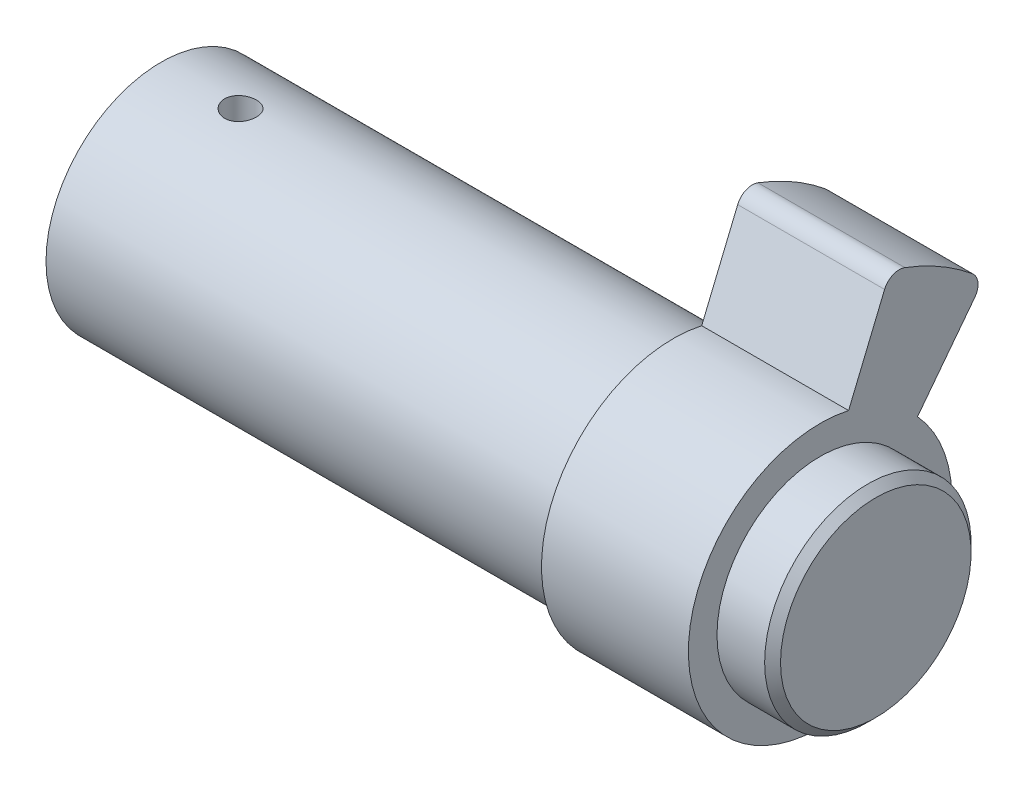
ISO-10303-21;
HEADER;
FILE_DESCRIPTION(('STEP AP214'),'2;1');
FILE_NAME('part.step','',(''),(''),'','','');
FILE_SCHEMA(('AUTOMOTIVE_DESIGN { 1 0 10303 214 1 1 1 1 }'));
ENDSEC;
DATA;
#1=APPLICATION_CONTEXT('core data for automotive mechanical design processes');
#2=APPLICATION_PROTOCOL_DEFINITION('international standard','automotive_design',2000,#1);
#3=PRODUCT_CONTEXT('',#1,'mechanical');
#4=PRODUCT('Part','Part','',(#3));
#5=PRODUCT_RELATED_PRODUCT_CATEGORY('part','',(#4));
#6=PRODUCT_DEFINITION_FORMATION('','',#4);
#7=PRODUCT_DEFINITION_CONTEXT('part definition',#1,'design');
#8=PRODUCT_DEFINITION('design','',#6,#7);
#9=PRODUCT_DEFINITION_SHAPE('','',#8);
#10=(LENGTH_UNIT() NAMED_UNIT(*) SI_UNIT(.MILLI.,.METRE.));
#11=(NAMED_UNIT(*) PLANE_ANGLE_UNIT() SI_UNIT($,.RADIAN.));
#12=(NAMED_UNIT(*) SI_UNIT($,.STERADIAN.) SOLID_ANGLE_UNIT());
#13=UNCERTAINTY_MEASURE_WITH_UNIT(LENGTH_MEASURE(1.E-05),#10,'distance_accuracy_value','');
#14=(GEOMETRIC_REPRESENTATION_CONTEXT(3) GLOBAL_UNCERTAINTY_ASSIGNED_CONTEXT((#13)) GLOBAL_UNIT_ASSIGNED_CONTEXT((#10,
#11,#12)) REPRESENTATION_CONTEXT('',''));
#15=CARTESIAN_POINT('',(0.,0.,0.));
#16=DIRECTION('',(0.,0.,1.));
#17=DIRECTION('',(1.,0.,0.));
#18=AXIS2_PLACEMENT_3D('',#15,#16,#17);
#19=CARTESIAN_POINT('',(45.,0.,0.));
#20=DIRECTION('',(1.,0.,0.));
#21=DIRECTION('',(0.,0.,-1.));
#22=AXIS2_PLACEMENT_3D('',#19,#20,#21);
#23=PLANE('',#22);
#24=CARTESIAN_POINT('',(44.9999999999591,0.,0.));
#25=DIRECTION('',(-1.,0.,0.));
#26=DIRECTION('',(0.,0.,1.));
#27=AXIS2_PLACEMENT_3D('',#24,#25,#26);
#28=CIRCLE('',#27,6.00000000002865);
#29=CARTESIAN_POINT('',(44.9999999999591,0.,6.00000000002865));
#30=VERTEX_POINT('',#29);
#31=EDGE_CURVE('E20',#30,#30,#28,.T.);
#32=ORIENTED_EDGE('',*,*,#31,.F.);
#33=EDGE_LOOP('',(#32));
#34=FACE_BOUND('',#33,.T.);
#35=ADVANCED_FACE('F17',(#34),#23,.T.);
#36=CARTESIAN_POINT('',(44.5000000000277,0.,0.));
#37=DIRECTION('',(-1.,0.,0.));
#38=DIRECTION('',(0.,0.,1.));
#39=AXIS2_PLACEMENT_3D('',#36,#37,#38);
#40=CONICAL_SURFACE('',#39,6.49999999995998,0.785398163397448);
#41=ORIENTED_EDGE('',*,*,#31,.T.);
#42=EDGE_LOOP('',(#41));
#43=FACE_BOUND('',#42,.T.);
#44=CARTESIAN_POINT('',(44.5,0.,0.));
#45=DIRECTION('',(-1.,0.,0.));
#46=DIRECTION('',(0.,0.,1.));
#47=AXIS2_PLACEMENT_3D('',#44,#45,#46);
#48=CIRCLE('',#47,6.5);
#49=CARTESIAN_POINT('',(44.5,0.,6.5));
#50=VERTEX_POINT('',#49);
#51=EDGE_CURVE('E98',#50,#50,#48,.T.);
#52=ORIENTED_EDGE('',*,*,#51,.F.);
#53=EDGE_LOOP('',(#52));
#54=FACE_BOUND('',#53,.T.);
#55=ADVANCED_FACE('F220',(#43,#54),#40,.T.);
#56=CARTESIAN_POINT('',(45.,0.,0.));
#57=DIRECTION('',(-1.,0.,0.));
#58=DIRECTION('',(0.,0.,1.));
#59=AXIS2_PLACEMENT_3D('',#56,#57,#58);
#60=CYLINDRICAL_SURFACE('',#59,6.5);
#61=ORIENTED_EDGE('',*,*,#51,.T.);
#62=EDGE_LOOP('',(#61));
#63=FACE_BOUND('',#62,.T.);
#64=CARTESIAN_POINT('',(41.5,0.,0.));
#65=DIRECTION('',(-1.,0.,0.));
#66=DIRECTION('',(0.,0.,1.));
#67=AXIS2_PLACEMENT_3D('',#64,#65,#66);
#68=CIRCLE('',#67,6.5);
#69=CARTESIAN_POINT('',(41.5,0.,6.5));
#70=VERTEX_POINT('',#69);
#71=EDGE_CURVE('E342',#70,#70,#68,.F.);
#72=ORIENTED_EDGE('',*,*,#71,.T.);
#73=EDGE_LOOP('',(#72));
#74=FACE_BOUND('',#73,.T.);
#75=ADVANCED_FACE('F218',(#63,#74),#60,.T.);
#76=CARTESIAN_POINT('',(41.5,10.9062733382579,-8.93662139016782));
#77=DIRECTION('',(-1.,0.,0.));
#78=DIRECTION('',(0.,0.,1.));
#79=AXIS2_PLACEMENT_3D('',#76,#77,#78);
#80=CYLINDRICAL_SURFACE('',#79,1.);
#81=CARTESIAN_POINT('',(32.25,10.9062733382579,-8.93662139016782));
#82=DIRECTION('',(-1.,0.,0.));
#83=DIRECTION('',(0.,0.,1.));
#84=AXIS2_PLACEMENT_3D('',#81,#82,#83);
#85=CIRCLE('',#84,1.);
#86=CARTESIAN_POINT('',(32.25,10.2975119092492,-9.72997473045906));
#87=VERTEX_POINT('',#86);
#88=CARTESIAN_POINT('',(32.25,11.6797679012549,-9.57042432564072));
#89=VERTEX_POINT('',#88);
#90=EDGE_CURVE('E85',#87,#89,#85,.F.);
#91=ORIENTED_EDGE('',*,*,#90,.T.);
#92=DIRECTION('',(-1.,0.,0.));
#93=VECTOR('',#92,1.);
#94=CARTESIAN_POINT('',(41.5,11.6797679012549,-9.57042432564072));
#95=LINE('',#94,#93);
#96=CARTESIAN_POINT('',(41.5,11.6797679012549,-9.57042432564072));
#97=VERTEX_POINT('',#96);
#98=EDGE_CURVE('E92',#97,#89,#95,.T.);
#99=ORIENTED_EDGE('',*,*,#98,.F.);
#100=CARTESIAN_POINT('',(41.5,10.9062733382579,-8.93662139016782));
#101=DIRECTION('',(-1.,0.,0.));
#102=DIRECTION('',(0.,0.,1.));
#103=AXIS2_PLACEMENT_3D('',#100,#101,#102);
#104=CIRCLE('',#103,1.);
#105=CARTESIAN_POINT('',(41.5,10.2975119092492,-9.72997473045906));
#106=VERTEX_POINT('',#105);
#107=EDGE_CURVE('E338',#97,#106,#104,.T.);
#108=ORIENTED_EDGE('',*,*,#107,.T.);
#109=DIRECTION('',(1.,0.,0.));
#110=VECTOR('',#109,1.);
#111=CARTESIAN_POINT('',(41.5,10.2975119092492,-9.72997473045906));
#112=LINE('',#111,#110);
#113=EDGE_CURVE('E95',#106,#87,#112,.F.);
#114=ORIENTED_EDGE('',*,*,#113,.T.);
#115=EDGE_LOOP('',(#91,#99,#108,#114));
#116=FACE_BOUND('',#115,.T.);
#117=ADVANCED_FACE('F91',(#116),#80,.T.);
#118=CARTESIAN_POINT('',(41.5,13.1924778170177,-4.97679907646437));
#119=DIRECTION('',(-1.,0.,0.));
#120=DIRECTION('',(0.,0.,1.));
#121=AXIS2_PLACEMENT_3D('',#118,#119,#120);
#122=CYLINDRICAL_SURFACE('',#121,1.);
#123=CARTESIAN_POINT('',(32.25,13.1924778170177,-4.97679907646437));
#124=DIRECTION('',(-1.,0.,0.));
#125=DIRECTION('',(0.,0.,1.));
#126=AXIS2_PLACEMENT_3D('',#123,#124,#125);
#127=CIRCLE('',#126,1.);
#128=CARTESIAN_POINT('',(32.25,14.1281145416289,-5.32976354997248));
#129=VERTEX_POINT('',#128);
#130=CARTESIAN_POINT('',(32.25,13.5751612493828,-4.05291954395308));
#131=VERTEX_POINT('',#130);
#132=EDGE_CURVE('E97',#129,#131,#127,.F.);
#133=ORIENTED_EDGE('',*,*,#132,.T.);
#134=DIRECTION('',(1.,0.,0.));
#135=VECTOR('',#134,1.);
#136=CARTESIAN_POINT('',(41.5,13.5751612493828,-4.05291954395308));
#137=LINE('',#136,#135);
#138=CARTESIAN_POINT('',(41.5,13.5751612493828,-4.05291954395308));
#139=VERTEX_POINT('',#138);
#140=EDGE_CURVE('E285',#131,#139,#137,.T.);
#141=ORIENTED_EDGE('',*,*,#140,.T.);
#142=CARTESIAN_POINT('',(41.5,13.1924778170177,-4.97679907646437));
#143=DIRECTION('',(-1.,0.,0.));
#144=DIRECTION('',(0.,0.,1.));
#145=AXIS2_PLACEMENT_3D('',#142,#143,#144);
#146=CIRCLE('',#145,1.);
#147=CARTESIAN_POINT('',(41.5,14.1281145416289,-5.32976354997248));
#148=VERTEX_POINT('',#147);
#149=EDGE_CURVE('E340',#139,#148,#146,.T.);
#150=ORIENTED_EDGE('',*,*,#149,.T.);
#151=DIRECTION('',(-1.,0.,0.));
#152=VECTOR('',#151,1.);
#153=CARTESIAN_POINT('',(41.5,14.1281145416289,-5.32976354997248));
#154=LINE('',#153,#152);
#155=EDGE_CURVE('E106',#129,#148,#154,.F.);
#156=ORIENTED_EDGE('',*,*,#155,.F.);
#157=EDGE_LOOP('',(#133,#141,#150,#156));
#158=FACE_BOUND('',#157,.T.);
#159=ADVANCED_FACE('F211',(#158),#122,.T.);
#160=CARTESIAN_POINT('',(41.5,0.,0.));
#161=DIRECTION('',(-1.,0.,0.));
#162=DIRECTION('',(0.,0.,1.));
#163=AXIS2_PLACEMENT_3D('',#160,#161,#162);
#164=PLANE('',#163);
#165=ORIENTED_EDGE('',*,*,#107,.F.);
#166=CARTESIAN_POINT('',(41.5,0.,0.));
#167=DIRECTION('',(-1.,0.,0.));
#168=DIRECTION('',(0.,0.,1.));
#169=AXIS2_PLACEMENT_3D('',#166,#167,#168);
#170=CIRCLE('',#169,15.1);
#171=EDGE_CURVE('E105',#148,#97,#170,.T.);
#172=ORIENTED_EDGE('',*,*,#171,.F.);
#173=ORIENTED_EDGE('',*,*,#149,.F.);
#174=DIRECTION('',(0.,0.923879532511284,-0.382683432365097));
#175=VECTOR('',#174,1.);
#176=CARTESIAN_POINT('',(41.5,14.4411734153491,-4.41163352827646));
#177=LINE('',#176,#175);
#178=CARTESIAN_POINT('',(41.5,8.10529576165426,-1.78722707457936));
#179=VERTEX_POINT('',#178);
#180=EDGE_CURVE('E283',#139,#179,#177,.F.);
#181=ORIENTED_EDGE('',*,*,#180,.T.);
#182=CARTESIAN_POINT('',(41.5,0.,0.));
#183=DIRECTION('',(-1.,0.,0.));
#184=DIRECTION('',(0.,0.,1.));
#185=AXIS2_PLACEMENT_3D('',#182,#183,#184);
#186=CIRCLE('',#185,8.3);
#187=CARTESIAN_POINT('',(41.5,5.60043192974418,-6.12577849748927));
#188=VERTEX_POINT('',#187);
#189=EDGE_CURVE('E294',#188,#179,#186,.T.);
#190=ORIENTED_EDGE('',*,*,#189,.F.);
#191=DIRECTION('',(0.,-0.793353340291239,0.608761429008716));
#192=VECTOR('',#191,1.);
#193=CARTESIAN_POINT('',(41.5,11.0411734153491,-10.3006062740106));
#194=LINE('',#193,#192);
#195=EDGE_CURVE('E235',#188,#106,#194,.F.);
#196=ORIENTED_EDGE('',*,*,#195,.T.);
#197=EDGE_LOOP('',(#165,#172,#173,#181,#190,#196));
#198=FACE_BOUND('',#197,.T.);
#199=ORIENTED_EDGE('',*,*,#71,.F.);
#200=EDGE_LOOP('',(#199));
#201=FACE_BOUND('',#200,.T.);
#202=ADVANCED_FACE('F207',(#198,#201),#164,.F.);
#203=CARTESIAN_POINT('',(32.25,0.,0.));
#204=DIRECTION('',(-1.,0.,0.));
#205=DIRECTION('',(0.,0.,1.));
#206=AXIS2_PLACEMENT_3D('',#203,#204,#205);
#207=PLANE('',#206);
#208=DIRECTION('',(0.,0.,1.));
#209=VECTOR('',#208,1.);
#210=CARTESIAN_POINT('',(32.25,2.,-1.25));
#211=LINE('',#210,#209);
#212=CARTESIAN_POINT('',(32.25,2.,1.25));
#213=VERTEX_POINT('',#212);
#214=CARTESIAN_POINT('',(32.25,2.,-1.25));
#215=VERTEX_POINT('',#214);
#216=EDGE_CURVE('E256',#213,#215,#211,.F.);
#217=ORIENTED_EDGE('',*,*,#216,.T.);
#218=DIRECTION('',(0.,1.,0.));
#219=VECTOR('',#218,1.);
#220=CARTESIAN_POINT('',(32.25,2.,-1.25));
#221=LINE('',#220,#219);
#222=CARTESIAN_POINT('',(32.25,-6.25,-1.25));
#223=VERTEX_POINT('',#222);
#224=EDGE_CURVE('E263',#215,#223,#221,.F.);
#225=ORIENTED_EDGE('',*,*,#224,.T.);
#226=DIRECTION('',(0.,0.,-1.));
#227=VECTOR('',#226,1.);
#228=CARTESIAN_POINT('',(32.25,-6.25,-1.25));
#229=LINE('',#228,#227);
#230=CARTESIAN_POINT('',(32.25,-6.25,1.25));
#231=VERTEX_POINT('',#230);
#232=EDGE_CURVE('E275',#223,#231,#229,.F.);
#233=ORIENTED_EDGE('',*,*,#232,.T.);
#234=DIRECTION('',(0.,-1.,0.));
#235=VECTOR('',#234,1.);
#236=CARTESIAN_POINT('',(32.25,2.,1.25));
#237=LINE('',#236,#235);
#238=EDGE_CURVE('E269',#231,#213,#237,.F.);
#239=ORIENTED_EDGE('',*,*,#238,.T.);
#240=EDGE_LOOP('',(#217,#225,#233,#239));
#241=FACE_BOUND('',#240,.T.);
#242=ADVANCED_FACE('F204',(#241),#207,.T.);
#243=CARTESIAN_POINT('',(41.5,0.,0.));
#244=DIRECTION('',(-1.,0.,0.));
#245=DIRECTION('',(0.,0.,1.));
#246=AXIS2_PLACEMENT_3D('',#243,#244,#245);
#247=CYLINDRICAL_SURFACE('',#246,15.1);
#248=CARTESIAN_POINT('',(32.25,0.,0.));
#249=DIRECTION('',(-1.,0.,0.));
#250=DIRECTION('',(0.,0.,1.));
#251=AXIS2_PLACEMENT_3D('',#248,#249,#250);
#252=CIRCLE('',#251,15.1);
#253=EDGE_CURVE('E103',#129,#89,#252,.T.);
#254=ORIENTED_EDGE('',*,*,#253,.F.);
#255=ORIENTED_EDGE('',*,*,#155,.T.);
#256=ORIENTED_EDGE('',*,*,#171,.T.);
#257=ORIENTED_EDGE('',*,*,#98,.T.);
#258=EDGE_LOOP('',(#254,#255,#256,#257));
#259=FACE_BOUND('',#258,.T.);
#260=ADVANCED_FACE('F101',(#259),#247,.T.);
#261=CARTESIAN_POINT('',(41.5,11.0411734153491,-10.3006062740106));
#262=DIRECTION('',(0.,0.608761429008716,0.793353340291239));
#263=DIRECTION('',(0.,-0.793353340291239,0.608761429008716));
#264=AXIS2_PLACEMENT_3D('',#261,#262,#263);
#265=PLANE('',#264);
#266=ORIENTED_EDGE('',*,*,#113,.F.);
#267=ORIENTED_EDGE('',*,*,#195,.F.);
#268=DIRECTION('',(-1.,0.,0.));
#269=VECTOR('',#268,1.);
#270=CARTESIAN_POINT('',(41.5,5.60043192974418,-6.12577849748926));
#271=LINE('',#270,#269);
#272=CARTESIAN_POINT('',(32.25,5.60043192974419,-6.12577849748926));
#273=VERTEX_POINT('',#272);
#274=EDGE_CURVE('E298',#273,#188,#271,.F.);
#275=ORIENTED_EDGE('',*,*,#274,.F.);
#276=DIRECTION('',(0.,-0.793353340291239,0.608761429008716));
#277=VECTOR('',#276,1.);
#278=CARTESIAN_POINT('',(32.25,10.2975119092492,-9.72997473045906));
#279=LINE('',#278,#277);
#280=EDGE_CURVE('E111',#87,#273,#279,.T.);
#281=ORIENTED_EDGE('',*,*,#280,.F.);
#282=EDGE_LOOP('',(#266,#267,#275,#281));
#283=FACE_BOUND('',#282,.T.);
#284=ADVANCED_FACE('F197',(#283),#265,.F.);
#285=CARTESIAN_POINT('',(41.5,0.,0.));
#286=DIRECTION('',(-1.,0.,0.));
#287=DIRECTION('',(0.,0.,1.));
#288=AXIS2_PLACEMENT_3D('',#285,#286,#287);
#289=CYLINDRICAL_SURFACE('',#288,8.3);
#290=DIRECTION('',(1.,0.,0.));
#291=VECTOR('',#290,1.);
#292=CARTESIAN_POINT('',(41.5,8.10529576165426,-1.78722707457936));
#293=LINE('',#292,#291);
#294=CARTESIAN_POINT('',(32.25,8.10529576165426,-1.78722707457936));
#295=VERTEX_POINT('',#294);
#296=EDGE_CURVE('E290',#179,#295,#293,.F.);
#297=ORIENTED_EDGE('',*,*,#296,.T.);
#298=CARTESIAN_POINT('',(32.25,0.,0.));
#299=DIRECTION('',(-1.,0.,0.));
#300=DIRECTION('',(0.,0.,1.));
#301=AXIS2_PLACEMENT_3D('',#298,#299,#300);
#302=CIRCLE('',#301,8.3);
#303=EDGE_CURVE('E114',#273,#295,#302,.T.);
#304=ORIENTED_EDGE('',*,*,#303,.F.);
#305=ORIENTED_EDGE('',*,*,#274,.T.);
#306=ORIENTED_EDGE('',*,*,#189,.T.);
#307=EDGE_LOOP('',(#297,#304,#305,#306));
#308=FACE_BOUND('',#307,.T.);
#309=ADVANCED_FACE('F193',(#308),#289,.T.);
#310=CARTESIAN_POINT('',(41.5,14.4411734153491,-4.41163352827646));
#311=DIRECTION('',(0.,-0.382683432365097,-0.923879532511284));
#312=DIRECTION('',(0.,0.923879532511284,-0.382683432365097));
#313=AXIS2_PLACEMENT_3D('',#310,#311,#312);
#314=PLANE('',#313);
#315=ORIENTED_EDGE('',*,*,#140,.F.);
#316=DIRECTION('',(0.,0.923879532511284,-0.382683432365097));
#317=VECTOR('',#316,1.);
#318=CARTESIAN_POINT('',(32.25,8.10529576165426,-1.78722707457936));
#319=LINE('',#318,#317);
#320=EDGE_CURVE('E183',#295,#131,#319,.T.);
#321=ORIENTED_EDGE('',*,*,#320,.F.);
#322=ORIENTED_EDGE('',*,*,#296,.F.);
#323=ORIENTED_EDGE('',*,*,#180,.F.);
#324=EDGE_LOOP('',(#315,#321,#322,#323));
#325=FACE_BOUND('',#324,.T.);
#326=ADVANCED_FACE('F189',(#325),#314,.F.);
#327=CARTESIAN_POINT('',(5.,35.,0.));
#328=DIRECTION('',(0.,-1.,0.));
#329=DIRECTION('',(0.,0.,-1.));
#330=AXIS2_PLACEMENT_3D('',#327,#328,#329);
#331=CYLINDRICAL_SURFACE('',#330,1.);
#332=CARTESIAN_POINT('',(5.,7.18070330817254,-1.));
#333=CARTESIAN_POINT('',(5.05583092252825,7.18070420570197,-0.999997506706467));
#334=CARTESIAN_POINT('',(5.11173446976674,7.18136201154282,-0.995304779072233));
#335=CARTESIAN_POINT('',(5.22202199965267,7.1839223009072,-0.976650254365614));
#336=CARTESIAN_POINT('',(5.27640259960566,7.18582735643132,-0.962669302817219));
#337=CARTESIAN_POINT('',(5.38197256228186,7.19066240463804,-0.925859795407066));
#338=CARTESIAN_POINT('',(5.43316544636477,7.19359124184075,-0.903041210919993));
#339=CARTESIAN_POINT('',(5.53097288710095,7.20014221161936,-0.849225114023525));
#340=CARTESIAN_POINT('',(5.57758927697457,7.20376406486301,-0.818230895047748));
#341=CARTESIAN_POINT('',(5.66526623272058,7.21132142593411,-0.74871208283638));
#342=CARTESIAN_POINT('',(5.70629076937359,7.21525873004016,-0.710142236079475));
#343=CARTESIAN_POINT('',(5.78130865352364,7.22298742540225,-0.626662894468753));
#344=CARTESIAN_POINT('',(5.81530127930559,7.2267788016486,-0.581752749678081));
#345=CARTESIAN_POINT('',(5.87541639727753,7.2338064638837,-0.486645016443901));
#346=CARTESIAN_POINT('',(5.90150666788128,7.23704045467194,-0.436426877485282));
#347=CARTESIAN_POINT('',(5.9448695594005,7.24256952535023,-0.332269959615615));
#348=CARTESIAN_POINT('',(5.96214265280799,7.24486465555033,-0.27833138025019));
#349=CARTESIAN_POINT('',(5.98727451278554,7.2482449934304,-0.168628174356073));
#350=CARTESIAN_POINT('',(5.99519243776723,7.24933780106679,-0.112877338358838));
#351=CARTESIAN_POINT('',(6.00157270774973,7.25021636609379,-0.000828218561134461));
#352=CARTESIAN_POINT('',(6.00003548461855,7.25000218318176,0.0554700401182953));
#353=CARTESIAN_POINT('',(5.98759617112012,7.24829701300697,0.166612247564158));
#354=CARTESIAN_POINT('',(5.9767577976581,7.24681471310824,0.221463479817657));
#355=CARTESIAN_POINT('',(5.94612348829491,7.24274954674007,0.328561574289508));
#356=CARTESIAN_POINT('',(5.92632727431407,7.24016664610466,0.380808355601573));
#357=CARTESIAN_POINT('',(5.8782719612081,7.23417542571909,0.481410661479401));
#358=CARTESIAN_POINT('',(5.84998538055084,7.23076443256776,0.529752893021718));
#359=CARTESIAN_POINT('',(5.78577472563159,7.2234982994777,0.621024615889333));
#360=CARTESIAN_POINT('',(5.74985083498755,7.219643170218,0.663954237306318));
#361=CARTESIAN_POINT('',(5.67103655780434,7.21188207614354,0.743553924039968));
#362=CARTESIAN_POINT('',(5.62809189378762,7.20797595287442,0.780170246035542));
#363=CARTESIAN_POINT('',(5.53661527448014,7.20058201770957,0.845700970268461));
#364=CARTESIAN_POINT('',(5.48808078661362,7.19709439689708,0.874611861599065));
#365=CARTESIAN_POINT('',(5.38673742735357,7.19093211489438,0.923913396640633));
#366=CARTESIAN_POINT('',(5.33392267964184,7.18825859616053,0.944292081714916));
#367=CARTESIAN_POINT('',(5.22564617801063,7.18404523080903,0.975833625406256));
#368=CARTESIAN_POINT('',(5.17019029176125,7.18250298553394,0.987015989271699));
#369=CARTESIAN_POINT('',(5.09529016075649,7.18131021812896,0.995633398101801));
#370=CARTESIAN_POINT('',(5.07627201577249,7.18108310616462,0.997269612547973));
#371=CARTESIAN_POINT('',(5.03817207755431,7.18077949769804,0.999453340067789));
#372=CARTESIAN_POINT('',(5.01909028428454,7.18070300128002,1.00000085253261));
#373=CARTESIAN_POINT('',(4.94416907747176,7.18070420570198,0.999997506706467));
#374=CARTESIAN_POINT('',(4.88826553023326,7.18136201154282,0.995304779072233));
#375=CARTESIAN_POINT('',(4.77797800034733,7.1839223009072,0.976650254365614));
#376=CARTESIAN_POINT('',(4.72359740039434,7.18582735643132,0.96266930281722));
#377=CARTESIAN_POINT('',(4.61802743771814,7.19066240463804,0.925859795407067));
#378=CARTESIAN_POINT('',(4.56683455363523,7.19359124184075,0.903041210919993));
#379=CARTESIAN_POINT('',(4.46902711289906,7.20014221161936,0.849225114023525));
#380=CARTESIAN_POINT('',(4.42241072302543,7.20376406486301,0.818230895047748));
#381=CARTESIAN_POINT('',(4.33473376727942,7.21132142593411,0.748712082836381));
#382=CARTESIAN_POINT('',(4.29370923062641,7.21525873004016,0.710142236079476));
#383=CARTESIAN_POINT('',(4.21869134647636,7.22298742540225,0.626662894468755));
#384=CARTESIAN_POINT('',(4.18469872069441,7.2267788016486,0.581752749678083));
#385=CARTESIAN_POINT('',(4.12458360272248,7.2338064638837,0.486645016443903));
#386=CARTESIAN_POINT('',(4.09849333211872,7.23704045467194,0.436426877485283));
#387=CARTESIAN_POINT('',(4.0551304405995,7.24256952535023,0.332269959615616));
#388=CARTESIAN_POINT('',(4.03785734719201,7.24486465555033,0.278331380250191));
#389=CARTESIAN_POINT('',(4.01272548721446,7.2482449934304,0.168628174356074));
#390=CARTESIAN_POINT('',(4.00480756223277,7.24933780106679,0.11287733835884));
#391=CARTESIAN_POINT('',(3.99842729225027,7.25021636609379,0.000828218561136006));
#392=CARTESIAN_POINT('',(3.99996451538145,7.25000218318176,-0.0554700401182938));
#393=CARTESIAN_POINT('',(4.01240382887988,7.24829701300697,-0.166612247564157));
#394=CARTESIAN_POINT('',(4.0232422023419,7.24681471310824,-0.221463479817655));
#395=CARTESIAN_POINT('',(4.05387651170509,7.24274954674007,-0.328561574289506));
#396=CARTESIAN_POINT('',(4.07367272568593,7.24016664610466,-0.380808355601572));
#397=CARTESIAN_POINT('',(4.1217280387919,7.23417542571909,-0.481410661479399));
#398=CARTESIAN_POINT('',(4.15001461944916,7.23076443256776,-0.529752893021716));
#399=CARTESIAN_POINT('',(4.21422527436841,7.2234982994777,-0.621024615889332));
#400=CARTESIAN_POINT('',(4.25014916501245,7.219643170218,-0.663954237306316));
#401=CARTESIAN_POINT('',(4.32896344219566,7.21188207614354,-0.743553924039967));
#402=CARTESIAN_POINT('',(4.37190810621238,7.20797595287442,-0.780170246035541));
#403=CARTESIAN_POINT('',(4.46338472551986,7.20058201770957,-0.84570097026846));
#404=CARTESIAN_POINT('',(4.51191921338638,7.19709439689708,-0.874611861599064));
#405=CARTESIAN_POINT('',(4.61326257264642,7.19093211489438,-0.923913396640632));
#406=CARTESIAN_POINT('',(4.66607732035816,7.18825859616053,-0.944292081714915));
#407=CARTESIAN_POINT('',(4.77435382198937,7.18404523080903,-0.975833625406255));
#408=CARTESIAN_POINT('',(4.82980970823875,7.18250298553394,-0.987015989271698));
#409=CARTESIAN_POINT('',(4.90470983924351,7.18131021812896,-0.995633398101801));
#410=CARTESIAN_POINT('',(4.92372798422751,7.18108310616462,-0.997269612547973));
#411=CARTESIAN_POINT('',(4.96182792244569,7.18077949769804,-0.999453340067789));
#412=CARTESIAN_POINT('',(4.98090971571546,7.18070300128002,-1.00000085253261));
#413=CARTESIAN_POINT('',(5.,7.18070330817254,-1.));
#414=B_SPLINE_CURVE_WITH_KNOTS('',3,(#332,#333,#334,#335,#336,#337,#338,#339,#340,#341,#342,
#343,#344,#345,#346,#347,#348,#349,#350,#351,#352,#353,#354,#355,#356,#357,#358,#359,#360,#361,
#362,#363,#364,#365,#366,#367,#368,#369,#370,#371,#372,#373,#374,#375,#376,#377,#378,#379,#380,
#381,#382,#383,#384,#385,#386,#387,#388,#389,#390,#391,#392,#393,#394,#395,#396,#397,#398,#399,
#400,#401,#402,#403,#404,#405,#406,#407,#408,#409,#410,#411,#412,#413),.UNSPECIFIED.,.T.,.F.,(4,
2,2,2,2,2,2,2,2,2,2,2,2,2,2,2,2,2,2,2,2,2,2,2,2,2,2,2,2,2,2,2,2,2,2,2,2,2,2,2,4),(0.,
0.167419967640368,0.335186270355509,0.502763833614684,0.670273993548007,0.838817012224232,
1.00737732061855,1.1766159517186,1.34584551276148,1.51399910540938,1.68214501762573,
1.84914816955725,2.01615650614986,2.18371135233679,2.35126217058733,2.5201755530237,
2.68916576818061,2.85839205142962,3.02725847599042,3.08450440432427,3.14175036467081,
3.30917033231118,3.47693663502632,3.6445141982855,3.81202435821882,3.98056737689505,
4.14912768528937,4.31836631638942,4.4875958774323,4.65574947008019,4.82389538229654,
4.99089853422806,5.15790687082068,5.3254617170076,5.49301253525814,5.66192591769452,
5.83091613285142,6.00014241610043,6.16900884066124,6.22625476899509,6.28350072934163),.UNSPECIFIED.);
#415=CARTESIAN_POINT('',(5.,7.18070330817254,-1.));
#416=VERTEX_POINT('',#415);
#417=EDGE_CURVE('E177',#416,#416,#414,.T.);
#418=ORIENTED_EDGE('',*,*,#417,.F.);
#419=EDGE_LOOP('',(#418));
#420=FACE_BOUND('',#419,.T.);
#421=CARTESIAN_POINT('',(5.,2.,0.));
#422=DIRECTION('',(0.,-1.,0.));
#423=DIRECTION('',(0.,0.,-1.));
#424=AXIS2_PLACEMENT_3D('',#421,#422,#423);
#425=CIRCLE('',#424,1.);
#426=CARTESIAN_POINT('',(5.,2.,-1.));
#427=VERTEX_POINT('',#426);
#428=EDGE_CURVE('E272',#427,#427,#425,.T.);
#429=ORIENTED_EDGE('',*,*,#428,.T.);
#430=EDGE_LOOP('',(#429));
#431=FACE_BOUND('',#430,.T.);
#432=ADVANCED_FACE('F162',(#420,#431),#331,.F.);
#433=CARTESIAN_POINT('',(32.25,2.,1.25));
#434=DIRECTION('',(0.,0.,1.));
#435=DIRECTION('',(0.,-1.,0.));
#436=AXIS2_PLACEMENT_3D('',#433,#434,#435);
#437=PLANE('',#436);
#438=DIRECTION('',(0.,1.,0.));
#439=VECTOR('',#438,1.);
#440=CARTESIAN_POINT('',(0.,0.,1.25));
#441=LINE('',#440,#439);
#442=CARTESIAN_POINT('',(-6.49220027941602E-12,-1.05051025724783,1.25));
#443=VERTEX_POINT('',#442);
#444=CARTESIAN_POINT('',(0.,2.,1.25));
#445=VERTEX_POINT('',#444);
#446=EDGE_CURVE('E182',#443,#445,#441,.T.);
#447=ORIENTED_EDGE('',*,*,#446,.T.);
#448=DIRECTION('',(1.,0.,0.));
#449=VECTOR('',#448,1.);
#450=CARTESIAN_POINT('',(32.25,2.,1.25));
#451=LINE('',#450,#449);
#452=EDGE_CURVE('E260',#445,#213,#451,.T.);
#453=ORIENTED_EDGE('',*,*,#452,.T.);
#454=ORIENTED_EDGE('',*,*,#238,.F.);
#455=DIRECTION('',(1.,0.,0.));
#456=VECTOR('',#455,1.);
#457=CARTESIAN_POINT('',(32.25,-6.25,1.25));
#458=LINE('',#457,#456);
#459=CARTESIAN_POINT('',(0.,-6.25,1.25));
#460=VERTEX_POINT('',#459);
#461=EDGE_CURVE('E116',#231,#460,#458,.F.);
#462=ORIENTED_EDGE('',*,*,#461,.T.);
#463=DIRECTION('',(0.,-1.,0.));
#464=VECTOR('',#463,1.);
#465=CARTESIAN_POINT('',(0.,2.,1.25));
#466=LINE('',#465,#464);
#467=CARTESIAN_POINT('',(-6.49100825354379E-12,-5.94948974275217,1.25));
#468=VERTEX_POINT('',#467);
#469=EDGE_CURVE('E35',#468,#460,#466,.T.);
#470=ORIENTED_EDGE('',*,*,#469,.F.);
#471=CARTESIAN_POINT('',(-1.07699996360478E-11,-5.94948974276143,1.25000000000413));
#472=CARTESIAN_POINT('',(0.0636370567234537,-5.87802115235243,1.25000000000149));
#473=CARTESIAN_POINT('',(0.126978558382424,-5.80628464076387,1.2500000000004));
#474=CARTESIAN_POINT('',(0.252853989397266,-5.66206122503463,1.2499999999996));
#475=CARTESIAN_POINT('',(0.315387615745873,-5.58957405671745,1.24999999999989));
#476=CARTESIAN_POINT('',(0.440179189664534,-5.44275113416053,1.25000000000011));
#477=CARTESIAN_POINT('',(0.502423315964222,-5.36840359454176,1.25000000000003));
#478=CARTESIAN_POINT('',(0.625409060421624,-5.21849614338167,1.24999999999997));
#479=CARTESIAN_POINT('',(0.686150980685107,-5.14293648073104,1.24999999999999));
#480=CARTESIAN_POINT('',(0.802417204020658,-4.99419457966718,1.25000000000001));
#481=CARTESIAN_POINT('',(0.858047965584757,-4.92109601010088,1.25));
#482=CARTESIAN_POINT('',(0.966643739722215,-4.77295132887118,1.25));
#483=CARTESIAN_POINT('',(1.01960927975573,-4.69790560704968,1.25));
#484=CARTESIAN_POINT('',(1.12148436332356,-4.54536252393208,1.25));
#485=CARTESIAN_POINT('',(1.17040438924146,-4.46787226654029,1.25));
#486=CARTESIAN_POINT('',(1.26220337074045,-4.30945581635922,1.25));
#487=CARTESIAN_POINT('',(1.30508997429237,-4.2285341457944,1.25));
#488=CARTESIAN_POINT('',(1.37866329487437,-4.06810698624441,1.25));
#489=CARTESIAN_POINT('',(1.41000483050575,-3.98891691424929,1.25));
#490=CARTESIAN_POINT('',(1.4476855162227,-3.86741566704056,1.25));
#491=CARTESIAN_POINT('',(1.45867711454306,-3.8265511722994,1.25));
#492=CARTESIAN_POINT('',(1.47703757122578,-3.74402675862483,1.25));
#493=CARTESIAN_POINT('',(1.48440869440108,-3.70236735394223,1.25));
#494=CARTESIAN_POINT('',(1.49516197230457,-3.61788934401603,1.25));
#495=CARTESIAN_POINT('',(1.49848245234633,-3.57506272811573,1.25));
#496=CARTESIAN_POINT('',(1.50068926314842,-3.48929648503968,1.25));
#497=CARTESIAN_POINT('',(1.49957594886696,-3.44635686718563,1.25));
#498=CARTESIAN_POINT('',(1.492990234335,-3.36070696864625,1.25));
#499=CARTESIAN_POINT('',(1.48750645972499,-3.3179975795326,1.25));
#500=CARTESIAN_POINT('',(1.47254381731652,-3.23328803859704,1.25));
#501=CARTESIAN_POINT('',(1.46306383483784,-3.1912880880643,1.25));
#502=CARTESIAN_POINT('',(1.43696934890084,-3.09456836282816,1.25));
#503=CARTESIAN_POINT('',(1.41903384302847,-3.04020768776857,1.25));
#504=CARTESIAN_POINT('',(1.37843096557415,-2.93329512789616,1.25));
#505=CARTESIAN_POINT('',(1.35576079737323,-2.88074433359087,1.25));
#506=CARTESIAN_POINT('',(1.3066107490945,-2.77681927592477,1.25));
#507=CARTESIAN_POINT('',(1.28009423393051,-2.72546257111354,1.25));
#508=CARTESIAN_POINT('',(1.22435089607168,-2.62428018055839,1.25));
#509=CARTESIAN_POINT('',(1.19512489229301,-2.57445403823939,1.25));
#510=CARTESIAN_POINT('',(1.12252102860398,-2.4563777052702,1.25));
#511=CARTESIAN_POINT('',(1.078160697477,-2.38873497965989,1.25));
#512=CARTESIAN_POINT('',(0.986670000184227,-2.25533884683269,1.25));
#513=CARTESIAN_POINT('',(0.939538644635639,-2.18958612706424,1.25));
#514=CARTESIAN_POINT('',(0.843220925142794,-2.05943651674871,1.25));
#515=CARTESIAN_POINT('',(0.79403118046049,-1.99504214068578,1.25));
#516=CARTESIAN_POINT('',(0.694195521341934,-1.86739112756697,1.25));
#517=CARTESIAN_POINT('',(0.643549515043424,-1.80413456269617,1.25));
#518=CARTESIAN_POINT('',(0.544336877826152,-1.68241569322937,1.25));
#519=CARTESIAN_POINT('',(0.49583621626402,-1.62389945334681,1.25));
#520=CARTESIAN_POINT('',(0.398074755383198,-1.50750181627509,1.25));
#521=CARTESIAN_POINT('',(0.348813920087904,-1.44962044935562,1.25));
#522=CARTESIAN_POINT('',(0.249900062352879,-1.334622842396,1.25));
#523=CARTESIAN_POINT('',(0.200249602566964,-1.27750439400354,1.25));
#524=CARTESIAN_POINT('',(0.100463243877935,-1.16370334179018,1.25));
#525=CARTESIAN_POINT('',(0.0503273959063424,-1.10702069333721,1.25));
#526=CARTESIAN_POINT('',(-1.33341128644414E-11,-1.05051025724014,1.25));
#527=B_SPLINE_CURVE_WITH_KNOTS('',3,(#471,#472,#473,#474,#475,#476,#477,#478,#479,#480,#481,
#482,#483,#484,#485,#486,#487,#488,#489,#490,#491,#492,#493,#494,#495,#496,#497,#498,#499,#500,
#501,#502,#503,#504,#505,#506,#507,#508,#509,#510,#511,#512,#513,#514,#515,#516,#517,#518,#519,
#520,#521,#522,#523,#524,#525,#526),.UNSPECIFIED.,.F.,.F.,(4,2,2,2,2,2,2,2,2,2,2,2,2,2,2,2,2,2,
2,2,2,2,2,2,2,2,2,4),(0.,0.287087962143282,0.574280645724391,0.865156593820115,1.15597356072348,
1.43151100812249,1.70699370912487,1.98173864722001,2.25613211839815,2.51082606932662,
2.63764172235575,2.76437794363001,2.89302067621067,3.0216531101907,3.15062141456204,
3.27962571647097,3.45105344337953,3.62258271519287,3.79586848653677,3.96910205366058,
4.21166863696105,4.45432235990415,4.69739159611062,4.94047619912188,5.1684775632596,
5.39648975127303,5.62353117737908,5.85054903292884),.UNSPECIFIED.);
#528=EDGE_CURVE('E112',#468,#443,#527,.T.);
#529=ORIENTED_EDGE('',*,*,#528,.T.);
#530=EDGE_LOOP('',(#447,#453,#454,#462,#470,#529));
#531=FACE_BOUND('',#530,.T.);
#532=ADVANCED_FACE('F133',(#531),#437,.F.);
#533=CARTESIAN_POINT('',(32.25,2.,-1.25));
#534=DIRECTION('',(0.,1.,0.));
#535=DIRECTION('',(0.,0.,1.));
#536=AXIS2_PLACEMENT_3D('',#533,#534,#535);
#537=PLANE('',#536);
#538=DIRECTION('',(1.,0.,0.));
#539=VECTOR('',#538,1.);
#540=CARTESIAN_POINT('',(32.25,2.,-1.25));
#541=LINE('',#540,#539);
#542=CARTESIAN_POINT('',(0.,2.,-1.25));
#543=VERTEX_POINT('',#542);
#544=EDGE_CURVE('E259',#543,#215,#541,.T.);
#545=ORIENTED_EDGE('',*,*,#544,.T.);
#546=ORIENTED_EDGE('',*,*,#216,.F.);
#547=ORIENTED_EDGE('',*,*,#452,.F.);
#548=DIRECTION('',(0.,0.,-1.));
#549=VECTOR('',#548,1.);
#550=CARTESIAN_POINT('',(0.,2.,0.));
#551=LINE('',#550,#549);
#552=EDGE_CURVE('E319',#445,#543,#551,.T.);
#553=ORIENTED_EDGE('',*,*,#552,.T.);
#554=EDGE_LOOP('',(#545,#546,#547,#553));
#555=FACE_BOUND('',#554,.T.);
#556=ORIENTED_EDGE('',*,*,#428,.F.);
#557=EDGE_LOOP('',(#556));
#558=FACE_BOUND('',#557,.T.);
#559=ADVANCED_FACE('F154',(#555,#558),#537,.F.);
#560=CARTESIAN_POINT('',(32.25,2.,-1.25));
#561=DIRECTION('',(0.,0.,-1.));
#562=DIRECTION('',(0.,1.,0.));
#563=AXIS2_PLACEMENT_3D('',#560,#561,#562);
#564=PLANE('',#563);
#565=DIRECTION('',(0.,1.,0.));
#566=VECTOR('',#565,1.);
#567=CARTESIAN_POINT('',(0.,2.,-1.25));
#568=LINE('',#567,#566);
#569=CARTESIAN_POINT('',(0.,-6.25,-1.25));
#570=VERTEX_POINT('',#569);
#571=CARTESIAN_POINT('',(-6.49173456919044E-12,-5.94948974275218,-1.25));
#572=VERTEX_POINT('',#571);
#573=EDGE_CURVE('E266',#570,#572,#568,.T.);
#574=ORIENTED_EDGE('',*,*,#573,.F.);
#575=DIRECTION('',(1.,0.,0.));
#576=VECTOR('',#575,1.);
#577=CARTESIAN_POINT('',(32.25,-6.25,-1.25));
#578=LINE('',#577,#576);
#579=EDGE_CURVE('E278',#570,#223,#578,.T.);
#580=ORIENTED_EDGE('',*,*,#579,.T.);
#581=ORIENTED_EDGE('',*,*,#224,.F.);
#582=ORIENTED_EDGE('',*,*,#544,.F.);
#583=DIRECTION('',(0.,1.,0.));
#584=VECTOR('',#583,1.);
#585=CARTESIAN_POINT('',(0.,0.,-1.25));
#586=LINE('',#585,#584);
#587=CARTESIAN_POINT('',(-6.49189774142684E-12,-1.05051025724783,-1.25));
#588=VERTEX_POINT('',#587);
#589=EDGE_CURVE('E249',#543,#588,#586,.F.);
#590=ORIENTED_EDGE('',*,*,#589,.T.);
#591=CARTESIAN_POINT('',(-1.07711199959142E-11,-1.05051025723857,-1.25000000000413));
#592=CARTESIAN_POINT('',(0.0636370567234527,-1.12197884764757,-1.25000000000149));
#593=CARTESIAN_POINT('',(0.126978558382423,-1.19371535923614,-1.2500000000004));
#594=CARTESIAN_POINT('',(0.252853989397265,-1.33793877496537,-1.2499999999996));
#595=CARTESIAN_POINT('',(0.315387615745871,-1.41042594328255,-1.24999999999989));
#596=CARTESIAN_POINT('',(0.440179189664532,-1.55724886583947,-1.25000000000011));
#597=CARTESIAN_POINT('',(0.502423315964221,-1.63159640545824,-1.25000000000003));
#598=CARTESIAN_POINT('',(0.625409060421623,-1.78150385661833,-1.24999999999997));
#599=CARTESIAN_POINT('',(0.686150980685106,-1.85706351926896,-1.24999999999999));
#600=CARTESIAN_POINT('',(0.802417204020657,-2.00580542033282,-1.25000000000001));
#601=CARTESIAN_POINT('',(0.858047965584756,-2.07890398989912,-1.25));
#602=CARTESIAN_POINT('',(0.966643739722215,-2.22704867112882,-1.25));
#603=CARTESIAN_POINT('',(1.01960927975573,-2.30209439295032,-1.25));
#604=CARTESIAN_POINT('',(1.12148436332356,-2.45463747606792,-1.25));
#605=CARTESIAN_POINT('',(1.17040438924146,-2.53212773345971,-1.25));
#606=CARTESIAN_POINT('',(1.26220337074045,-2.69054418364078,-1.25));
#607=CARTESIAN_POINT('',(1.30508997429237,-2.7714658542056,-1.25));
#608=CARTESIAN_POINT('',(1.37866329487437,-2.93189301375558,-1.25));
#609=CARTESIAN_POINT('',(1.41000483050575,-3.0110830857507,-1.25));
#610=CARTESIAN_POINT('',(1.4476855162227,-3.13258433295944,-1.25));
#611=CARTESIAN_POINT('',(1.45867711454306,-3.1734488277006,-1.25));
#612=CARTESIAN_POINT('',(1.47703757122578,-3.25597324137517,-1.25));
#613=CARTESIAN_POINT('',(1.48440869440108,-3.29763264605777,-1.25));
#614=CARTESIAN_POINT('',(1.49516197230457,-3.38211065598397,-1.25));
#615=CARTESIAN_POINT('',(1.49848245234633,-3.42493727188427,-1.25));
#616=CARTESIAN_POINT('',(1.50068926314842,-3.51070351496031,-1.25));
#617=CARTESIAN_POINT('',(1.49957594886696,-3.55364313281437,-1.25));
#618=CARTESIAN_POINT('',(1.492990234335,-3.63929303135375,-1.25));
#619=CARTESIAN_POINT('',(1.48750645972499,-3.6820024204674,-1.25));
#620=CARTESIAN_POINT('',(1.47254381731652,-3.76671196140296,-1.25));
#621=CARTESIAN_POINT('',(1.46306383483784,-3.80871191193569,-1.25));
#622=CARTESIAN_POINT('',(1.43696934890084,-3.90543163717183,-1.25));
#623=CARTESIAN_POINT('',(1.41903384302847,-3.95979231223143,-1.25));
#624=CARTESIAN_POINT('',(1.37843096557415,-4.06670487210384,-1.25));
#625=CARTESIAN_POINT('',(1.35576079737323,-4.11925566640913,-1.25));
#626=CARTESIAN_POINT('',(1.3066107490945,-4.22318072407523,-1.25));
#627=CARTESIAN_POINT('',(1.28009423393051,-4.27453742888646,-1.25));
#628=CARTESIAN_POINT('',(1.22435089607169,-4.37571981944161,-1.25));
#629=CARTESIAN_POINT('',(1.19512489229301,-4.42554596176061,-1.25));
#630=CARTESIAN_POINT('',(1.12252102860398,-4.5436222947298,-1.25));
#631=CARTESIAN_POINT('',(1.078160697477,-4.61126502034011,-1.25));
#632=CARTESIAN_POINT('',(0.986670000184229,-4.74466115316731,-1.25));
#633=CARTESIAN_POINT('',(0.93953864463564,-4.81041387293576,-1.25));
#634=CARTESIAN_POINT('',(0.843220925142796,-4.94056348325129,-1.25));
#635=CARTESIAN_POINT('',(0.794031180460491,-5.00495785931422,-1.25));
#636=CARTESIAN_POINT('',(0.694195521341936,-5.13260887243303,-1.25));
#637=CARTESIAN_POINT('',(0.643549515043426,-5.19586543730383,-1.25));
#638=CARTESIAN_POINT('',(0.544336877826153,-5.31758430677063,-1.25));
#639=CARTESIAN_POINT('',(0.495836216264021,-5.37610054665319,-1.25));
#640=CARTESIAN_POINT('',(0.398074755383199,-5.49249818372491,-1.25));
#641=CARTESIAN_POINT('',(0.348813920087905,-5.55037955064439,-1.25));
#642=CARTESIAN_POINT('',(0.24990006235288,-5.665377157604,-1.25));
#643=CARTESIAN_POINT('',(0.200249602566964,-5.72249560599646,-1.25));
#644=CARTESIAN_POINT('',(0.100463243877935,-5.83629665820982,-1.25));
#645=CARTESIAN_POINT('',(0.0503273959063422,-5.89297930666279,-1.25));
#646=CARTESIAN_POINT('',(-1.33348912513823E-11,-5.94948974275986,-1.25));
#647=B_SPLINE_CURVE_WITH_KNOTS('',3,(#591,#592,#593,#594,#595,#596,#597,#598,#599,#600,#601,
#602,#603,#604,#605,#606,#607,#608,#609,#610,#611,#612,#613,#614,#615,#616,#617,#618,#619,#620,
#621,#622,#623,#624,#625,#626,#627,#628,#629,#630,#631,#632,#633,#634,#635,#636,#637,#638,#639,
#640,#641,#642,#643,#644,#645,#646),.UNSPECIFIED.,.F.,.F.,(4,2,2,2,2,2,2,2,2,2,2,2,2,2,2,2,2,2,
2,2,2,2,2,2,2,2,2,4),(0.,0.287087962143282,0.57428064572439,0.865156593820114,1.15597356072348,
1.43151100812249,1.70699370912487,1.98173864722001,2.25613211839815,2.51082606932662,
2.63764172235575,2.76437794363001,2.89302067621067,3.0216531101907,3.15062141456204,
3.27962571647096,3.45105344337953,3.62258271519287,3.79586848653676,3.96910205366057,
4.21166863696105,4.45432235990415,4.69739159611062,4.94047619912188,5.1684775632596,
5.39648975127303,5.62353117737908,5.85054903292885),.UNSPECIFIED.);
#648=EDGE_CURVE('E126',#588,#572,#647,.T.);
#649=ORIENTED_EDGE('',*,*,#648,.T.);
#650=EDGE_LOOP('',(#574,#580,#581,#582,#590,#649));
#651=FACE_BOUND('',#650,.T.);
#652=ADVANCED_FACE('F150',(#651),#564,.F.);
#653=CARTESIAN_POINT('',(0.,-3.5,0.));
#654=DIRECTION('',(-1.,0.,0.));
#655=DIRECTION('',(0.,-1.,0.));
#656=AXIS2_PLACEMENT_3D('',#653,#654,#655);
#657=CONICAL_SURFACE('',#656,2.74999999996589,0.785398163397448);
#658=CARTESIAN_POINT('',(0.,-3.5,0.));
#659=DIRECTION('',(-1.,0.,0.));
#660=DIRECTION('',(0.,-1.,0.));
#661=AXIS2_PLACEMENT_3D('',#658,#659,#660);
#662=CIRCLE('',#661,2.74999999996589);
#663=EDGE_CURVE('E184',#588,#572,#662,.T.);
#664=ORIENTED_EDGE('',*,*,#663,.T.);
#665=ORIENTED_EDGE('',*,*,#648,.F.);
#666=EDGE_LOOP('',(#664,#665));
#667=FACE_BOUND('',#666,.T.);
#668=ADVANCED_FACE('F146',(#667),#657,.F.);
#669=CARTESIAN_POINT('',(32.25,-6.25,-1.25));
#670=DIRECTION('',(0.,-1.,0.));
#671=DIRECTION('',(0.,0.,-1.));
#672=AXIS2_PLACEMENT_3D('',#669,#670,#671);
#673=PLANE('',#672);
#674=ORIENTED_EDGE('',*,*,#461,.F.);
#675=ORIENTED_EDGE('',*,*,#232,.F.);
#676=ORIENTED_EDGE('',*,*,#579,.F.);
#677=DIRECTION('',(0.,0.,-1.));
#678=VECTOR('',#677,1.);
#679=CARTESIAN_POINT('',(0.,-6.25,0.));
#680=LINE('',#679,#678);
#681=EDGE_CURVE('E240',#570,#460,#680,.F.);
#682=ORIENTED_EDGE('',*,*,#681,.T.);
#683=EDGE_LOOP('',(#674,#675,#676,#682));
#684=FACE_BOUND('',#683,.T.);
#685=ADVANCED_FACE('F142',(#684),#673,.F.);
#686=CARTESIAN_POINT('',(0.,-3.5,0.));
#687=DIRECTION('',(-1.,0.,0.));
#688=DIRECTION('',(0.,-1.,0.));
#689=AXIS2_PLACEMENT_3D('',#686,#687,#688);
#690=CONICAL_SURFACE('',#689,2.74999999996589,0.785398163397448);
#691=CARTESIAN_POINT('',(0.,-3.5,0.));
#692=DIRECTION('',(-1.,0.,0.));
#693=DIRECTION('',(0.,-1.,0.));
#694=AXIS2_PLACEMENT_3D('',#691,#692,#693);
#695=CIRCLE('',#694,2.74999999996589);
#696=EDGE_CURVE('E238',#468,#443,#695,.T.);
#697=ORIENTED_EDGE('',*,*,#696,.T.);
#698=ORIENTED_EDGE('',*,*,#528,.F.);
#699=EDGE_LOOP('',(#697,#698));
#700=FACE_BOUND('',#699,.T.);
#701=ADVANCED_FACE('F137',(#700),#690,.F.);
#702=CARTESIAN_POINT('',(32.25,0.,0.));
#703=DIRECTION('',(-1.,0.,0.));
#704=DIRECTION('',(0.,0.,1.));
#705=AXIS2_PLACEMENT_3D('',#702,#703,#704);
#706=PLANE('',#705);
#707=CARTESIAN_POINT('',(32.25,0.,0.));
#708=DIRECTION('',(-1.,0.,0.));
#709=DIRECTION('',(0.,0.,1.));
#710=AXIS2_PLACEMENT_3D('',#707,#708,#709);
#711=CIRCLE('',#710,7.25);
#712=CARTESIAN_POINT('',(32.25,0.,7.25));
#713=VERTEX_POINT('',#712);
#714=EDGE_CURVE('E26',#713,#713,#711,.T.);
#715=ORIENTED_EDGE('',*,*,#714,.F.);
#716=EDGE_LOOP('',(#715));
#717=FACE_BOUND('',#716,.T.);
#718=ORIENTED_EDGE('',*,*,#320,.T.);
#719=ORIENTED_EDGE('',*,*,#132,.F.);
#720=ORIENTED_EDGE('',*,*,#253,.T.);
#721=ORIENTED_EDGE('',*,*,#90,.F.);
#722=ORIENTED_EDGE('',*,*,#280,.T.);
#723=ORIENTED_EDGE('',*,*,#303,.T.);
#724=EDGE_LOOP('',(#718,#719,#720,#721,#722,#723));
#725=FACE_BOUND('',#724,.T.);
#726=ADVANCED_FACE('F109',(#717,#725),#706,.T.);
#727=CARTESIAN_POINT('',(0.,0.,0.));
#728=DIRECTION('',(1.,0.,0.));
#729=DIRECTION('',(0.,0.,-1.));
#730=AXIS2_PLACEMENT_3D('',#727,#728,#729);
#731=PLANE('',#730);
#732=CARTESIAN_POINT('',(0.,0.,0.));
#733=DIRECTION('',(-1.,0.,0.));
#734=DIRECTION('',(0.,0.,1.));
#735=AXIS2_PLACEMENT_3D('',#732,#733,#734);
#736=CIRCLE('',#735,7.25);
#737=CARTESIAN_POINT('',(0.,0.,7.25));
#738=VERTEX_POINT('',#737);
#739=EDGE_CURVE('E11',#738,#738,#736,.F.);
#740=ORIENTED_EDGE('',*,*,#739,.F.);
#741=EDGE_LOOP('',(#740));
#742=FACE_BOUND('',#741,.T.);
#743=ORIENTED_EDGE('',*,*,#469,.T.);
#744=ORIENTED_EDGE('',*,*,#681,.F.);
#745=ORIENTED_EDGE('',*,*,#573,.T.);
#746=ORIENTED_EDGE('',*,*,#663,.F.);
#747=ORIENTED_EDGE('',*,*,#589,.F.);
#748=ORIENTED_EDGE('',*,*,#552,.F.);
#749=ORIENTED_EDGE('',*,*,#446,.F.);
#750=ORIENTED_EDGE('',*,*,#696,.F.);
#751=EDGE_LOOP('',(#743,#744,#745,#746,#747,#748,#749,#750));
#752=FACE_BOUND('',#751,.T.);
#753=ADVANCED_FACE('F167',(#742,#752),#731,.F.);
#754=CARTESIAN_POINT('',(32.25,0.,0.));
#755=DIRECTION('',(-1.,0.,0.));
#756=DIRECTION('',(0.,0.,1.));
#757=AXIS2_PLACEMENT_3D('',#754,#755,#756);
#758=CYLINDRICAL_SURFACE('',#757,7.25);
#759=ORIENTED_EDGE('',*,*,#714,.T.);
#760=EDGE_LOOP('',(#759));
#761=FACE_BOUND('',#760,.T.);
#762=ORIENTED_EDGE('',*,*,#739,.T.);
#763=EDGE_LOOP('',(#762));
#764=FACE_BOUND('',#763,.T.);
#765=ORIENTED_EDGE('',*,*,#417,.T.);
#766=EDGE_LOOP('',(#765));
#767=FACE_BOUND('',#766,.T.);
#768=ADVANCED_FACE('F165',(#761,#764,#767),#758,.T.);
#769=CLOSED_SHELL('',(#35,#55,#75,#117,#159,#202,#242,#260,#284,#309,#326,#432,#532,#559,#652,
#668,#685,#701,#726,#753,#768));
#770=MANIFOLD_SOLID_BREP('B1',#769);
#771=ADVANCED_BREP_SHAPE_REPRESENTATION('',(#18,#770),#14);
#772=SHAPE_DEFINITION_REPRESENTATION(#9,#771);
ENDSEC;
END-ISO-10303-21;
